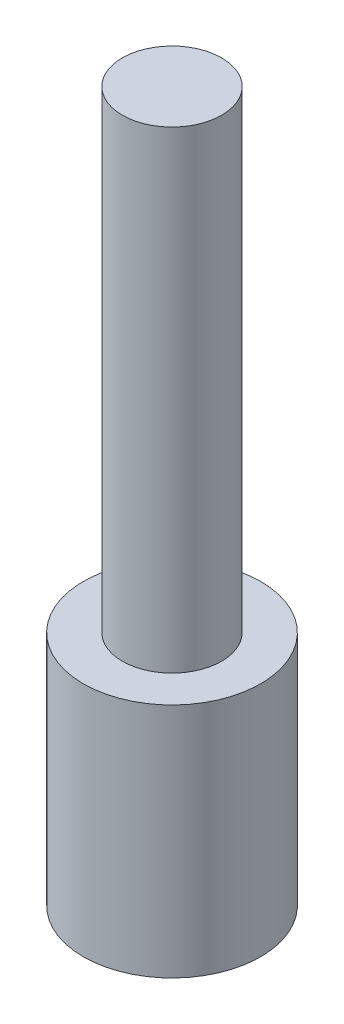
ISO-10303-21;
HEADER;
FILE_DESCRIPTION(('STEP AP214'),'2;1');
FILE_NAME('part.step','',(''),(''),'','','');
FILE_SCHEMA(('AUTOMOTIVE_DESIGN { 1 0 10303 214 1 1 1 1 }'));
ENDSEC;
DATA;
#1=APPLICATION_CONTEXT('core data for automotive mechanical design processes');
#2=APPLICATION_PROTOCOL_DEFINITION('international standard','automotive_design',2000,#1);
#3=PRODUCT_CONTEXT('',#1,'mechanical');
#4=PRODUCT('Part','Part','',(#3));
#5=PRODUCT_RELATED_PRODUCT_CATEGORY('part','',(#4));
#6=PRODUCT_DEFINITION_FORMATION('','',#4);
#7=PRODUCT_DEFINITION_CONTEXT('part definition',#1,'design');
#8=PRODUCT_DEFINITION('design','',#6,#7);
#9=PRODUCT_DEFINITION_SHAPE('','',#8);
#10=(LENGTH_UNIT() NAMED_UNIT(*) SI_UNIT(.MILLI.,.METRE.));
#11=(NAMED_UNIT(*) PLANE_ANGLE_UNIT() SI_UNIT($,.RADIAN.));
#12=(NAMED_UNIT(*) SI_UNIT($,.STERADIAN.) SOLID_ANGLE_UNIT());
#13=UNCERTAINTY_MEASURE_WITH_UNIT(LENGTH_MEASURE(1.E-05),#10,'distance_accuracy_value','');
#14=(GEOMETRIC_REPRESENTATION_CONTEXT(3) GLOBAL_UNCERTAINTY_ASSIGNED_CONTEXT((#13)) GLOBAL_UNIT_ASSIGNED_CONTEXT((#10,
#11,#12)) REPRESENTATION_CONTEXT('',''));
#15=CARTESIAN_POINT('',(0.,0.,0.));
#16=DIRECTION('',(0.,0.,1.));
#17=DIRECTION('',(1.,0.,0.));
#18=AXIS2_PLACEMENT_3D('',#15,#16,#17);
#19=CARTESIAN_POINT('',(-18.2226476707115,47.0384635299183,11.6278669854637));
#20=DIRECTION('',(0.,-1.,0.));
#21=DIRECTION('',(0.,0.,-1.));
#22=AXIS2_PLACEMENT_3D('',#19,#20,#21);
#23=CYLINDRICAL_SURFACE('',#22,37.5);
#24=CARTESIAN_POINT('',(-18.2226476707115,47.0384635299183,11.6278669854637));
#25=DIRECTION('',(0.,1.,0.));
#26=DIRECTION('',(0.,0.,1.));
#27=AXIS2_PLACEMENT_3D('',#24,#25,#26);
#28=CIRCLE('',#27,37.5);
#29=CARTESIAN_POINT('',(-18.2226476707115,47.0384635299183,49.1278669854637));
#30=VERTEX_POINT('',#29);
#31=EDGE_CURVE('P0_E10',#30,#30,#28,.T.);
#32=ORIENTED_EDGE('',*,*,#31,.F.);
#33=EDGE_LOOP('',(#32));
#34=FACE_BOUND('',#33,.T.);
#35=CARTESIAN_POINT('',(-18.2226476707115,-52.9615364700817,11.6278669854637));
#36=DIRECTION('',(0.,1.,0.));
#37=DIRECTION('',(0.,0.,1.));
#38=AXIS2_PLACEMENT_3D('',#35,#36,#37);
#39=CIRCLE('',#38,37.5);
#40=CARTESIAN_POINT('',(-18.2226476707115,-52.9615364700817,49.1278669854637));
#41=VERTEX_POINT('',#40);
#42=EDGE_CURVE('P0_E18',#41,#41,#39,.T.);
#43=ORIENTED_EDGE('',*,*,#42,.T.);
#44=EDGE_LOOP('',(#43));
#45=FACE_BOUND('',#44,.T.);
#46=ADVANCED_FACE('P0_F15',(#34,#45),#23,.T.);
#47=CARTESIAN_POINT('',(-18.2226476707115,47.0384635299183,11.6278669854637));
#48=DIRECTION('',(0.,1.,0.));
#49=DIRECTION('',(0.,0.,1.));
#50=AXIS2_PLACEMENT_3D('',#47,#48,#49);
#51=PLANE('',#50);
#52=ORIENTED_EDGE('',*,*,#31,.T.);
#53=EDGE_LOOP('',(#52));
#54=FACE_BOUND('',#53,.T.);
#55=ADVANCED_FACE('P0_F30',(#54),#51,.T.);
#56=CARTESIAN_POINT('',(-18.2226476707115,-52.9615364700817,11.6278669854637));
#57=DIRECTION('',(0.,1.,0.));
#58=DIRECTION('',(0.,0.,1.));
#59=AXIS2_PLACEMENT_3D('',#56,#57,#58);
#60=PLANE('',#59);
#61=ORIENTED_EDGE('',*,*,#42,.F.);
#62=EDGE_LOOP('',(#61));
#63=FACE_BOUND('',#62,.T.);
#64=ADVANCED_FACE('P0_F28',(#63),#60,.F.);
#65=CLOSED_SHELL('',(#46,#55,#64));
#66=MANIFOLD_SOLID_BREP('P0_B1',#65);
#67=CARTESIAN_POINT('',(-18.2226476707115,247.038463529918,11.6278669854637));
#68=DIRECTION('',(0.,-1.,0.));
#69=DIRECTION('',(0.,0.,-1.));
#70=AXIS2_PLACEMENT_3D('',#67,#68,#69);
#71=CYLINDRICAL_SURFACE('',#70,21.);
#72=CARTESIAN_POINT('',(-18.2226476707115,247.038463529918,11.6278669854637));
#73=DIRECTION('',(0.,1.,0.));
#74=DIRECTION('',(0.,0.,1.));
#75=AXIS2_PLACEMENT_3D('',#72,#73,#74);
#76=CIRCLE('',#75,21.);
#77=CARTESIAN_POINT('',(-18.2226476707115,247.038463529918,32.6278669854637));
#78=VERTEX_POINT('',#77);
#79=EDGE_CURVE('P1_E9',#78,#78,#76,.T.);
#80=ORIENTED_EDGE('',*,*,#79,.F.);
#81=EDGE_LOOP('',(#80));
#82=FACE_BOUND('',#81,.T.);
#83=CARTESIAN_POINT('',(-18.2226476707115,47.0384635299183,11.6278669854637));
#84=DIRECTION('',(0.,1.,0.));
#85=DIRECTION('',(0.,0.,1.));
#86=AXIS2_PLACEMENT_3D('',#83,#84,#85);
#87=CIRCLE('',#86,21.);
#88=CARTESIAN_POINT('',(-18.2226476707115,47.0384635299183,32.6278669854637));
#89=VERTEX_POINT('',#88);
#90=EDGE_CURVE('P1_E17',#89,#89,#87,.T.);
#91=ORIENTED_EDGE('',*,*,#90,.T.);
#92=EDGE_LOOP('',(#91));
#93=FACE_BOUND('',#92,.T.);
#94=ADVANCED_FACE('P1_F14',(#82,#93),#71,.T.);
#95=CARTESIAN_POINT('',(-18.2226476707115,247.038463529918,11.6278669854637));
#96=DIRECTION('',(0.,1.,0.));
#97=DIRECTION('',(0.,0.,1.));
#98=AXIS2_PLACEMENT_3D('',#95,#96,#97);
#99=PLANE('',#98);
#100=ORIENTED_EDGE('',*,*,#79,.T.);
#101=EDGE_LOOP('',(#100));
#102=FACE_BOUND('',#101,.T.);
#103=ADVANCED_FACE('P1_F29',(#102),#99,.T.);
#104=CARTESIAN_POINT('',(-18.2226476707115,47.0384635299183,11.6278669854637));
#105=DIRECTION('',(0.,1.,0.));
#106=DIRECTION('',(0.,0.,1.));
#107=AXIS2_PLACEMENT_3D('',#104,#105,#106);
#108=PLANE('',#107);
#109=ORIENTED_EDGE('',*,*,#90,.F.);
#110=EDGE_LOOP('',(#109));
#111=FACE_BOUND('',#110,.T.);
#112=ADVANCED_FACE('P1_F27',(#111),#108,.F.);
#113=CLOSED_SHELL('',(#94,#103,#112));
#114=MANIFOLD_SOLID_BREP('P1_B1',#113);
#115=ADVANCED_BREP_SHAPE_REPRESENTATION('',(#18,#66,#114),#14);
#116=SHAPE_DEFINITION_REPRESENTATION(#9,#115);
ENDSEC;
END-ISO-10303-21;
